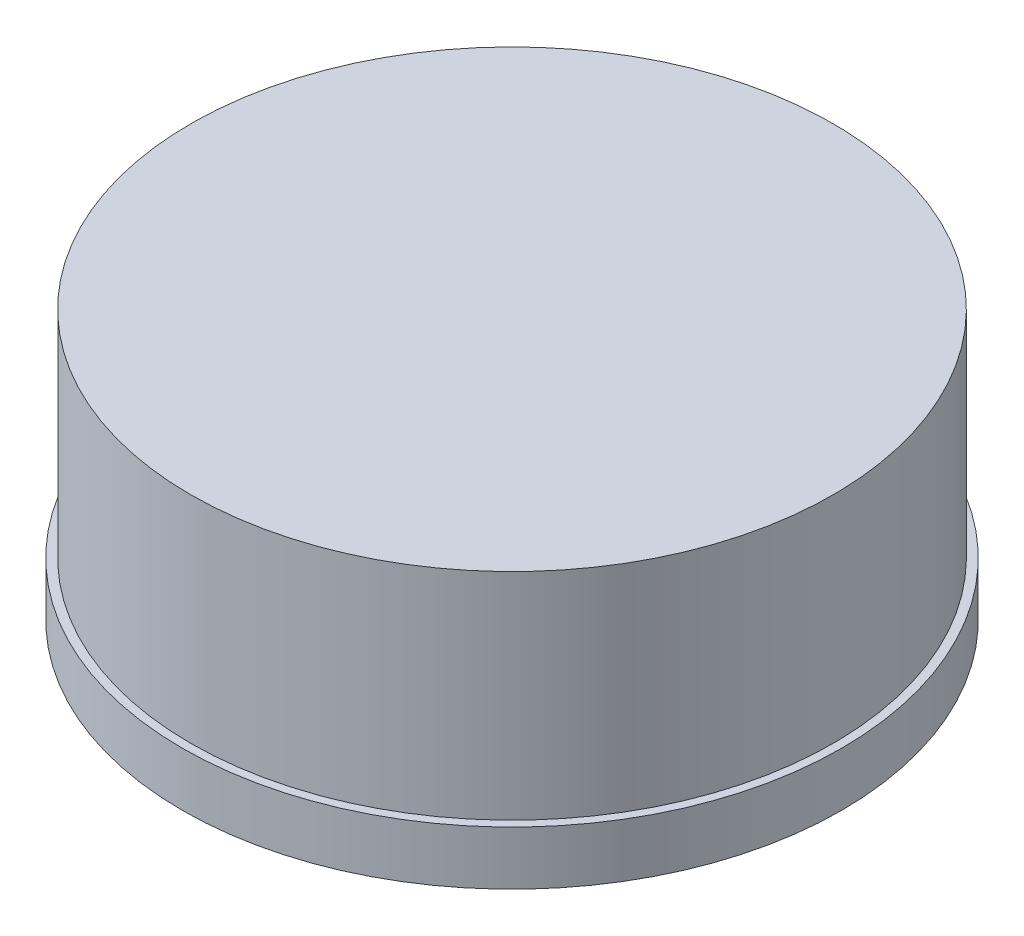
ISO-10303-21;
HEADER;
FILE_DESCRIPTION(('STEP AP214'),'2;1');
FILE_NAME('part.step','',(''),(''),'','','');
FILE_SCHEMA(('AUTOMOTIVE_DESIGN { 1 0 10303 214 1 1 1 1 }'));
ENDSEC;
DATA;
#1=APPLICATION_CONTEXT('core data for automotive mechanical design processes');
#2=APPLICATION_PROTOCOL_DEFINITION('international standard','automotive_design',2000,#1);
#3=PRODUCT_CONTEXT('',#1,'mechanical');
#4=PRODUCT('Part','Part','',(#3));
#5=PRODUCT_RELATED_PRODUCT_CATEGORY('part','',(#4));
#6=PRODUCT_DEFINITION_FORMATION('','',#4);
#7=PRODUCT_DEFINITION_CONTEXT('part definition',#1,'design');
#8=PRODUCT_DEFINITION('design','',#6,#7);
#9=PRODUCT_DEFINITION_SHAPE('','',#8);
#10=(LENGTH_UNIT() NAMED_UNIT(*) SI_UNIT(.MILLI.,.METRE.));
#11=(NAMED_UNIT(*) PLANE_ANGLE_UNIT() SI_UNIT($,.RADIAN.));
#12=(NAMED_UNIT(*) SI_UNIT($,.STERADIAN.) SOLID_ANGLE_UNIT());
#13=UNCERTAINTY_MEASURE_WITH_UNIT(LENGTH_MEASURE(1.E-05),#10,'distance_accuracy_value','');
#14=(GEOMETRIC_REPRESENTATION_CONTEXT(3) GLOBAL_UNCERTAINTY_ASSIGNED_CONTEXT((#13)) GLOBAL_UNIT_ASSIGNED_CONTEXT((#10,
#11,#12)) REPRESENTATION_CONTEXT('',''));
#15=CARTESIAN_POINT('',(0.,0.,0.));
#16=DIRECTION('',(0.,0.,1.));
#17=DIRECTION('',(1.,0.,0.));
#18=AXIS2_PLACEMENT_3D('',#15,#16,#17);
#19=CARTESIAN_POINT('',(0.,0.8,0.));
#20=DIRECTION('',(0.,-1.,0.));
#21=DIRECTION('',(0.,0.,-1.));
#22=AXIS2_PLACEMENT_3D('',#19,#20,#21);
#23=CYLINDRICAL_SURFACE('',#22,4.9);
#24=CARTESIAN_POINT('',(0.,0.8,0.));
#25=DIRECTION('',(0.,1.,0.));
#26=DIRECTION('',(0.,0.,1.));
#27=AXIS2_PLACEMENT_3D('',#24,#25,#26);
#28=CIRCLE('',#27,4.9);
#29=CARTESIAN_POINT('',(0.,0.8,4.9));
#30=VERTEX_POINT('',#29);
#31=EDGE_CURVE('E42',#30,#30,#28,.T.);
#32=ORIENTED_EDGE('',*,*,#31,.F.);
#33=EDGE_LOOP('',(#32));
#34=FACE_BOUND('',#33,.T.);
#35=CARTESIAN_POINT('',(0.,0.,0.));
#36=DIRECTION('',(0.,1.,0.));
#37=DIRECTION('',(0.,0.,1.));
#38=AXIS2_PLACEMENT_3D('',#35,#36,#37);
#39=CIRCLE('',#38,4.9);
#40=CARTESIAN_POINT('',(0.,0.,4.9));
#41=VERTEX_POINT('',#40);
#42=EDGE_CURVE('E38',#41,#41,#39,.T.);
#43=ORIENTED_EDGE('',*,*,#42,.T.);
#44=EDGE_LOOP('',(#43));
#45=FACE_BOUND('',#44,.T.);
#46=ADVANCED_FACE('F35',(#34,#45),#23,.T.);
#47=CARTESIAN_POINT('',(0.,0.8,0.));
#48=DIRECTION('',(0.,1.,0.));
#49=DIRECTION('',(0.,0.,1.));
#50=AXIS2_PLACEMENT_3D('',#47,#48,#49);
#51=PLANE('',#50);
#52=CARTESIAN_POINT('',(0.,0.8,0.));
#53=DIRECTION('',(0.,1.,0.));
#54=DIRECTION('',(0.,0.,1.));
#55=AXIS2_PLACEMENT_3D('',#52,#53,#54);
#56=CIRCLE('',#55,4.775);
#57=CARTESIAN_POINT('',(0.,0.8,4.775));
#58=VERTEX_POINT('',#57);
#59=EDGE_CURVE('E10',#58,#58,#56,.T.);
#60=ORIENTED_EDGE('',*,*,#59,.F.);
#61=EDGE_LOOP('',(#60));
#62=FACE_BOUND('',#61,.T.);
#63=ORIENTED_EDGE('',*,*,#31,.T.);
#64=EDGE_LOOP('',(#63));
#65=FACE_BOUND('',#64,.T.);
#66=ADVANCED_FACE('F71',(#62,#65),#51,.T.);
#67=CARTESIAN_POINT('',(0.,0.,0.));
#68=DIRECTION('',(0.,1.,0.));
#69=DIRECTION('',(0.,0.,1.));
#70=AXIS2_PLACEMENT_3D('',#67,#68,#69);
#71=PLANE('',#70);
#72=CARTESIAN_POINT('',(0.,0.,0.));
#73=DIRECTION('',(0.,-1.,0.));
#74=DIRECTION('',(0.,0.,-1.));
#75=AXIS2_PLACEMENT_3D('',#72,#73,#74);
#76=CIRCLE('',#75,4.05);
#77=CARTESIAN_POINT('',(0.,0.,-4.05));
#78=VERTEX_POINT('',#77);
#79=EDGE_CURVE('E52',#78,#78,#76,.T.);
#80=ORIENTED_EDGE('',*,*,#79,.F.);
#81=EDGE_LOOP('',(#80));
#82=FACE_BOUND('',#81,.T.);
#83=ORIENTED_EDGE('',*,*,#42,.F.);
#84=EDGE_LOOP('',(#83));
#85=FACE_BOUND('',#84,.T.);
#86=ADVANCED_FACE('F67',(#82,#85),#71,.F.);
#87=CARTESIAN_POINT('',(0.,4.,0.));
#88=DIRECTION('',(0.,-1.,0.));
#89=DIRECTION('',(0.,0.,-1.));
#90=AXIS2_PLACEMENT_3D('',#87,#88,#89);
#91=CYLINDRICAL_SURFACE('',#90,4.775);
#92=CARTESIAN_POINT('',(0.,4.,0.));
#93=DIRECTION('',(0.,1.,0.));
#94=DIRECTION('',(0.,0.,1.));
#95=AXIS2_PLACEMENT_3D('',#92,#93,#94);
#96=CIRCLE('',#95,4.775);
#97=CARTESIAN_POINT('',(0.,4.,4.775));
#98=VERTEX_POINT('',#97);
#99=EDGE_CURVE('E48',#98,#98,#96,.T.);
#100=ORIENTED_EDGE('',*,*,#99,.F.);
#101=EDGE_LOOP('',(#100));
#102=FACE_BOUND('',#101,.T.);
#103=ORIENTED_EDGE('',*,*,#59,.T.);
#104=EDGE_LOOP('',(#103));
#105=FACE_BOUND('',#104,.T.);
#106=ADVANCED_FACE('F70',(#102,#105),#91,.T.);
#107=CARTESIAN_POINT('',(0.,4.,0.));
#108=DIRECTION('',(0.,1.,0.));
#109=DIRECTION('',(0.,0.,1.));
#110=AXIS2_PLACEMENT_3D('',#107,#108,#109);
#111=PLANE('',#110);
#112=ORIENTED_EDGE('',*,*,#99,.T.);
#113=EDGE_LOOP('',(#112));
#114=FACE_BOUND('',#113,.T.);
#115=ADVANCED_FACE('F63',(#114),#111,.T.);
#116=CARTESIAN_POINT('',(0.,3.2,0.));
#117=DIRECTION('',(0.,-1.,0.));
#118=DIRECTION('',(0.,0.,-1.));
#119=AXIS2_PLACEMENT_3D('',#116,#117,#118);
#120=CYLINDRICAL_SURFACE('',#119,4.05);
#121=CARTESIAN_POINT('',(0.,3.2,0.));
#122=DIRECTION('',(0.,-1.,0.));
#123=DIRECTION('',(0.,0.,-1.));
#124=AXIS2_PLACEMENT_3D('',#121,#122,#123);
#125=CIRCLE('',#124,4.05);
#126=CARTESIAN_POINT('',(0.,3.2,-4.05));
#127=VERTEX_POINT('',#126);
#128=EDGE_CURVE('E51',#127,#127,#125,.T.);
#129=ORIENTED_EDGE('',*,*,#128,.F.);
#130=EDGE_LOOP('',(#129));
#131=FACE_BOUND('',#130,.T.);
#132=ORIENTED_EDGE('',*,*,#79,.T.);
#133=EDGE_LOOP('',(#132));
#134=FACE_BOUND('',#133,.T.);
#135=ADVANCED_FACE('F60',(#131,#134),#120,.F.);
#136=CARTESIAN_POINT('',(0.,3.2,0.));
#137=DIRECTION('',(0.,-1.,0.));
#138=DIRECTION('',(0.,0.,-1.));
#139=AXIS2_PLACEMENT_3D('',#136,#137,#138);
#140=PLANE('',#139);
#141=ORIENTED_EDGE('',*,*,#128,.T.);
#142=EDGE_LOOP('',(#141));
#143=FACE_BOUND('',#142,.T.);
#144=ADVANCED_FACE('F58',(#143),#140,.T.);
#145=CLOSED_SHELL('',(#46,#66,#86,#106,#115,#135,#144));
#146=MANIFOLD_SOLID_BREP('B2',#145);
#147=ADVANCED_BREP_SHAPE_REPRESENTATION('',(#18,#146),#14);
#148=SHAPE_DEFINITION_REPRESENTATION(#9,#147);
ENDSEC;
END-ISO-10303-21;
